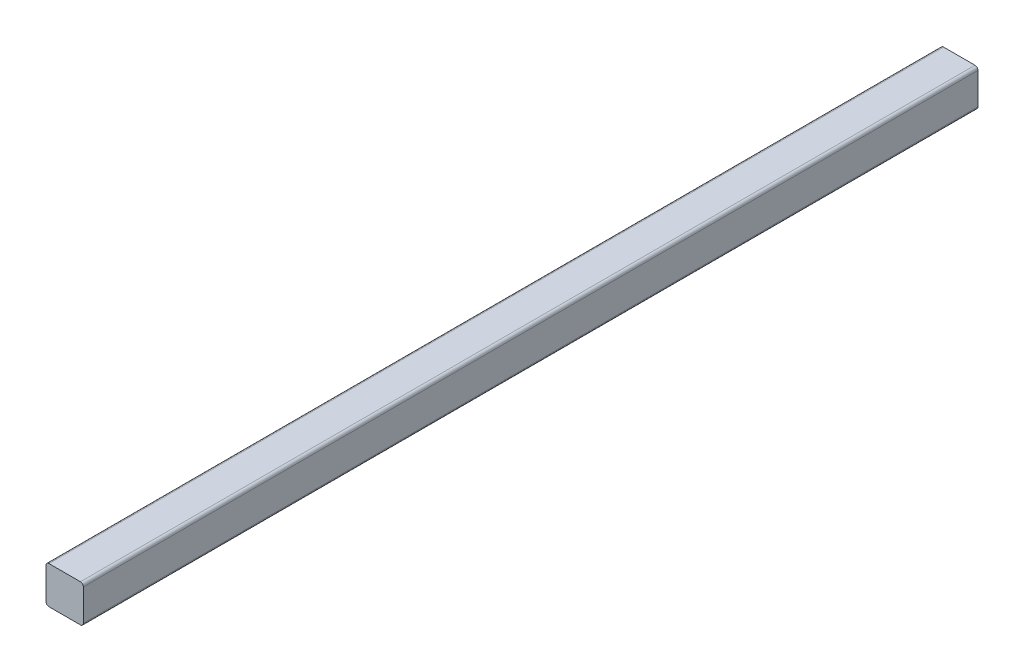
ISO-10303-21;
HEADER;
FILE_DESCRIPTION(('STEP AP214'),'2;1');
FILE_NAME('part.step','',(''),(''),'','','');
FILE_SCHEMA(('AUTOMOTIVE_DESIGN { 1 0 10303 214 1 1 1 1 }'));
ENDSEC;
DATA;
#1=APPLICATION_CONTEXT('core data for automotive mechanical design processes');
#2=APPLICATION_PROTOCOL_DEFINITION('international standard','automotive_design',2000,#1);
#3=PRODUCT_CONTEXT('',#1,'mechanical');
#4=PRODUCT('Part','Part','',(#3));
#5=PRODUCT_RELATED_PRODUCT_CATEGORY('part','',(#4));
#6=PRODUCT_DEFINITION_FORMATION('','',#4);
#7=PRODUCT_DEFINITION_CONTEXT('part definition',#1,'design');
#8=PRODUCT_DEFINITION('design','',#6,#7);
#9=PRODUCT_DEFINITION_SHAPE('','',#8);
#10=(LENGTH_UNIT() NAMED_UNIT(*) SI_UNIT(.MILLI.,.METRE.));
#11=(NAMED_UNIT(*) PLANE_ANGLE_UNIT() SI_UNIT($,.RADIAN.));
#12=(NAMED_UNIT(*) SI_UNIT($,.STERADIAN.) SOLID_ANGLE_UNIT());
#13=UNCERTAINTY_MEASURE_WITH_UNIT(LENGTH_MEASURE(1.E-05),#10,'distance_accuracy_value','');
#14=(GEOMETRIC_REPRESENTATION_CONTEXT(3) GLOBAL_UNCERTAINTY_ASSIGNED_CONTEXT((#13)) GLOBAL_UNIT_ASSIGNED_CONTEXT((#10,
#11,#12)) REPRESENTATION_CONTEXT('',''));
#15=CARTESIAN_POINT('',(0.,0.,0.));
#16=DIRECTION('',(0.,0.,1.));
#17=DIRECTION('',(1.,0.,0.));
#18=AXIS2_PLACEMENT_3D('',#15,#16,#17);
#19=CARTESIAN_POINT('',(-1.5875,1.5875,152.4));
#20=DIRECTION('',(0.,-1.,0.));
#21=DIRECTION('',(0.,0.,-1.));
#22=AXIS2_PLACEMENT_3D('',#19,#20,#21);
#23=PLANE('',#22);
#24=DIRECTION('',(0.,0.,-1.));
#25=VECTOR('',#24,1.);
#26=CARTESIAN_POINT('',(1.33350000000002,1.5875,152.4));
#27=LINE('',#26,#25);
#28=CARTESIAN_POINT('',(1.33349999999982,1.5875,-88.9));
#29=VERTEX_POINT('',#28);
#30=CARTESIAN_POINT('',(1.33349999999988,1.5875,-12.9496675796954));
#31=VERTEX_POINT('',#30);
#32=EDGE_CURVE('E126',#29,#31,#27,.F.);
#33=ORIENTED_EDGE('',*,*,#32,.F.);
#34=DIRECTION('',(-1.,0.,0.));
#35=VECTOR('',#34,1.);
#36=CARTESIAN_POINT('',(-1.5875,1.5875,-88.9));
#37=LINE('',#36,#35);
#38=CARTESIAN_POINT('',(-1.33349999999994,1.5875,-88.9));
#39=VERTEX_POINT('',#38);
#40=EDGE_CURVE('E153',#29,#39,#37,.T.);
#41=ORIENTED_EDGE('',*,*,#40,.T.);
#42=DIRECTION('',(0.,0.,-1.));
#43=VECTOR('',#42,1.);
#44=CARTESIAN_POINT('',(-1.33350000000002,1.5875,152.4));
#45=LINE('',#44,#43);
#46=CARTESIAN_POINT('',(-1.33349999999988,1.5875,-12.9496675796954));
#47=VERTEX_POINT('',#46);
#48=EDGE_CURVE('E123',#47,#39,#45,.T.);
#49=ORIENTED_EDGE('',*,*,#48,.F.);
#50=DIRECTION('',(1.,0.,0.));
#51=VECTOR('',#50,1.);
#52=CARTESIAN_POINT('',(-1.5875,1.5875,-12.9496675796954));
#53=LINE('',#52,#51);
#54=EDGE_CURVE('E133',#47,#31,#53,.T.);
#55=ORIENTED_EDGE('',*,*,#54,.T.);
#56=EDGE_LOOP('',(#33,#41,#49,#55));
#57=FACE_BOUND('',#56,.T.);
#58=ADVANCED_FACE('F33',(#57),#23,.F.);
#59=CARTESIAN_POINT('',(1.3335,1.3335,152.4));
#60=DIRECTION('',(0.,0.,-1.));
#61=DIRECTION('',(-1.,0.,0.));
#62=AXIS2_PLACEMENT_3D('',#59,#60,#61);
#63=CYLINDRICAL_SURFACE('',#62,0.254);
#64=CARTESIAN_POINT('',(1.3335,1.3335,-88.9));
#65=DIRECTION('',(0.,0.,1.));
#66=DIRECTION('',(1.,0.,0.));
#67=AXIS2_PLACEMENT_3D('',#64,#65,#66);
#68=CIRCLE('',#67,0.254);
#69=CARTESIAN_POINT('',(1.5875,1.33349999999994,-88.9));
#70=VERTEX_POINT('',#69);
#71=EDGE_CURVE('E156',#29,#70,#68,.F.);
#72=ORIENTED_EDGE('',*,*,#71,.F.);
#73=ORIENTED_EDGE('',*,*,#32,.T.);
#74=CARTESIAN_POINT('',(1.3335,1.3335,-12.9496675796954));
#75=DIRECTION('',(0.,0.,-1.));
#76=DIRECTION('',(-1.,0.,0.));
#77=AXIS2_PLACEMENT_3D('',#74,#75,#76);
#78=CIRCLE('',#77,0.254);
#79=CARTESIAN_POINT('',(1.5875,1.33349999999988,-12.9496675796954));
#80=VERTEX_POINT('',#79);
#81=EDGE_CURVE('E138',#80,#31,#78,.F.);
#82=ORIENTED_EDGE('',*,*,#81,.F.);
#83=DIRECTION('',(0.,0.,1.));
#84=VECTOR('',#83,1.);
#85=CARTESIAN_POINT('',(1.5875,1.33350000000002,152.4));
#86=LINE('',#85,#84);
#87=EDGE_CURVE('E120',#80,#70,#86,.F.);
#88=ORIENTED_EDGE('',*,*,#87,.T.);
#89=EDGE_LOOP('',(#72,#73,#82,#88));
#90=FACE_BOUND('',#89,.T.);
#91=ADVANCED_FACE('F171',(#90),#63,.T.);
#92=CARTESIAN_POINT('',(-1.3335,1.3335,152.4));
#93=DIRECTION('',(0.,0.,-1.));
#94=DIRECTION('',(-1.,0.,0.));
#95=AXIS2_PLACEMENT_3D('',#92,#93,#94);
#96=CYLINDRICAL_SURFACE('',#95,0.254);
#97=CARTESIAN_POINT('',(-1.3335,1.3335,-88.9));
#98=DIRECTION('',(0.,0.,1.));
#99=DIRECTION('',(1.,0.,0.));
#100=AXIS2_PLACEMENT_3D('',#97,#98,#99);
#101=CIRCLE('',#100,0.254);
#102=CARTESIAN_POINT('',(-1.5875,1.33349999999982,-88.9));
#103=VERTEX_POINT('',#102);
#104=EDGE_CURVE('E158',#103,#39,#101,.F.);
#105=ORIENTED_EDGE('',*,*,#104,.F.);
#106=DIRECTION('',(0.,0.,-1.));
#107=VECTOR('',#106,1.);
#108=CARTESIAN_POINT('',(-1.5875,1.33350000000002,152.4));
#109=LINE('',#108,#107);
#110=CARTESIAN_POINT('',(-1.5875,1.33349999999988,-12.9496675796954));
#111=VERTEX_POINT('',#110);
#112=EDGE_CURVE('E118',#103,#111,#109,.F.);
#113=ORIENTED_EDGE('',*,*,#112,.T.);
#114=CARTESIAN_POINT('',(-1.3335,1.3335,-12.9496675796954));
#115=DIRECTION('',(0.,0.,-1.));
#116=DIRECTION('',(-1.,0.,0.));
#117=AXIS2_PLACEMENT_3D('',#114,#115,#116);
#118=CIRCLE('',#117,0.254);
#119=EDGE_CURVE('E112',#47,#111,#118,.F.);
#120=ORIENTED_EDGE('',*,*,#119,.F.);
#121=ORIENTED_EDGE('',*,*,#48,.T.);
#122=EDGE_LOOP('',(#105,#113,#120,#121));
#123=FACE_BOUND('',#122,.T.);
#124=ADVANCED_FACE('F170',(#123),#96,.T.);
#125=CARTESIAN_POINT('',(1.5875,-1.5875,152.4));
#126=DIRECTION('',(-1.,0.,0.));
#127=DIRECTION('',(0.,0.,1.));
#128=AXIS2_PLACEMENT_3D('',#125,#126,#127);
#129=PLANE('',#128);
#130=DIRECTION('',(0.,0.,-1.));
#131=VECTOR('',#130,1.);
#132=CARTESIAN_POINT('',(1.5875,-1.33350000000002,152.4));
#133=LINE('',#132,#131);
#134=CARTESIAN_POINT('',(1.5875,-1.3335,-88.9));
#135=VERTEX_POINT('',#134);
#136=CARTESIAN_POINT('',(1.5875,-1.33349999999988,-12.9496675796954));
#137=VERTEX_POINT('',#136);
#138=EDGE_CURVE('E116',#135,#137,#133,.F.);
#139=ORIENTED_EDGE('',*,*,#138,.F.);
#140=DIRECTION('',(0.,1.,0.));
#141=VECTOR('',#140,1.);
#142=CARTESIAN_POINT('',(1.5875,-1.5875,-88.9));
#143=LINE('',#142,#141);
#144=EDGE_CURVE('E160',#135,#70,#143,.T.);
#145=ORIENTED_EDGE('',*,*,#144,.T.);
#146=ORIENTED_EDGE('',*,*,#87,.F.);
#147=DIRECTION('',(0.,-1.,0.));
#148=VECTOR('',#147,1.);
#149=CARTESIAN_POINT('',(1.5875,-1.5875,-12.9496675796954));
#150=LINE('',#149,#148);
#151=EDGE_CURVE('E141',#80,#137,#150,.T.);
#152=ORIENTED_EDGE('',*,*,#151,.T.);
#153=EDGE_LOOP('',(#139,#145,#146,#152));
#154=FACE_BOUND('',#153,.T.);
#155=ADVANCED_FACE('F175',(#154),#129,.F.);
#156=CARTESIAN_POINT('',(-1.5875,-1.5875,152.4));
#157=DIRECTION('',(1.,0.,0.));
#158=DIRECTION('',(0.,0.,-1.));
#159=AXIS2_PLACEMENT_3D('',#156,#157,#158);
#160=PLANE('',#159);
#161=ORIENTED_EDGE('',*,*,#112,.F.);
#162=DIRECTION('',(0.,-1.,0.));
#163=VECTOR('',#162,1.);
#164=CARTESIAN_POINT('',(-1.5875,-1.5875,-88.9));
#165=LINE('',#164,#163);
#166=CARTESIAN_POINT('',(-1.5875,-1.3335,-88.9));
#167=VERTEX_POINT('',#166);
#168=EDGE_CURVE('E163',#103,#167,#165,.T.);
#169=ORIENTED_EDGE('',*,*,#168,.T.);
#170=DIRECTION('',(0.,0.,-1.));
#171=VECTOR('',#170,1.);
#172=CARTESIAN_POINT('',(-1.5875,-1.3335,152.4));
#173=LINE('',#172,#171);
#174=CARTESIAN_POINT('',(-1.5875,-1.3335,-12.9496675796954));
#175=VERTEX_POINT('',#174);
#176=EDGE_CURVE('E104',#175,#167,#173,.T.);
#177=ORIENTED_EDGE('',*,*,#176,.F.);
#178=DIRECTION('',(0.,-1.,0.));
#179=VECTOR('',#178,1.);
#180=CARTESIAN_POINT('',(-1.5875,13.7833198887165,-12.9496675796954));
#181=LINE('',#180,#179);
#182=EDGE_CURVE('E151',#111,#175,#181,.T.);
#183=ORIENTED_EDGE('',*,*,#182,.F.);
#184=EDGE_LOOP('',(#161,#169,#177,#183));
#185=FACE_BOUND('',#184,.T.);
#186=ADVANCED_FACE('F167',(#185),#160,.F.);
#187=CARTESIAN_POINT('',(1.3335,-1.3335,152.4));
#188=DIRECTION('',(0.,0.,-1.));
#189=DIRECTION('',(-1.,0.,0.));
#190=AXIS2_PLACEMENT_3D('',#187,#188,#189);
#191=CYLINDRICAL_SURFACE('',#190,0.254);
#192=CARTESIAN_POINT('',(1.3335,-1.3335,-88.9));
#193=DIRECTION('',(0.,0.,1.));
#194=DIRECTION('',(1.,0.,0.));
#195=AXIS2_PLACEMENT_3D('',#192,#193,#194);
#196=CIRCLE('',#195,0.254);
#197=CARTESIAN_POINT('',(1.33350000000002,-1.5875,-88.9));
#198=VERTEX_POINT('',#197);
#199=EDGE_CURVE('E47',#135,#198,#196,.F.);
#200=ORIENTED_EDGE('',*,*,#199,.F.);
#201=ORIENTED_EDGE('',*,*,#138,.T.);
#202=CARTESIAN_POINT('',(1.3335,-1.3335,-12.9496675796954));
#203=DIRECTION('',(0.,0.,-1.));
#204=DIRECTION('',(-1.,0.,0.));
#205=AXIS2_PLACEMENT_3D('',#202,#203,#204);
#206=CIRCLE('',#205,0.254);
#207=CARTESIAN_POINT('',(1.33349999999988,-1.5875,-12.9496675796954));
#208=VERTEX_POINT('',#207);
#209=EDGE_CURVE('E146',#208,#137,#206,.F.);
#210=ORIENTED_EDGE('',*,*,#209,.F.);
#211=DIRECTION('',(0.,0.,1.));
#212=VECTOR('',#211,1.);
#213=CARTESIAN_POINT('',(1.33350000000002,-1.5875,152.4));
#214=LINE('',#213,#212);
#215=EDGE_CURVE('E108',#208,#198,#214,.F.);
#216=ORIENTED_EDGE('',*,*,#215,.T.);
#217=EDGE_LOOP('',(#200,#201,#210,#216));
#218=FACE_BOUND('',#217,.T.);
#219=ADVANCED_FACE('F177',(#218),#191,.T.);
#220=CARTESIAN_POINT('',(-1.3335,-1.3335,152.4));
#221=DIRECTION('',(0.,0.,-1.));
#222=DIRECTION('',(-1.,0.,0.));
#223=AXIS2_PLACEMENT_3D('',#220,#221,#222);
#224=CYLINDRICAL_SURFACE('',#223,0.254);
#225=CARTESIAN_POINT('',(-1.3335,-1.3335,-88.9));
#226=DIRECTION('',(0.,0.,1.));
#227=DIRECTION('',(1.,0.,0.));
#228=AXIS2_PLACEMENT_3D('',#225,#226,#227);
#229=CIRCLE('',#228,0.254);
#230=CARTESIAN_POINT('',(-1.33349999999989,-1.5875,-88.9));
#231=VERTEX_POINT('',#230);
#232=EDGE_CURVE('E96',#231,#167,#229,.F.);
#233=ORIENTED_EDGE('',*,*,#232,.F.);
#234=DIRECTION('',(0.,0.,1.));
#235=VECTOR('',#234,1.);
#236=CARTESIAN_POINT('',(-1.33350000000002,-1.5875,152.4));
#237=LINE('',#236,#235);
#238=CARTESIAN_POINT('',(-1.33350000000002,-1.5875,-12.9496675796954));
#239=VERTEX_POINT('',#238);
#240=EDGE_CURVE('E54',#231,#239,#237,.T.);
#241=ORIENTED_EDGE('',*,*,#240,.T.);
#242=CARTESIAN_POINT('',(-1.3335,-1.3335,-12.9496675796954));
#243=DIRECTION('',(0.,0.,-1.));
#244=DIRECTION('',(-1.,0.,0.));
#245=AXIS2_PLACEMENT_3D('',#242,#243,#244);
#246=CIRCLE('',#245,0.254);
#247=EDGE_CURVE('E149',#175,#239,#246,.F.);
#248=ORIENTED_EDGE('',*,*,#247,.F.);
#249=ORIENTED_EDGE('',*,*,#176,.T.);
#250=EDGE_LOOP('',(#233,#241,#248,#249));
#251=FACE_BOUND('',#250,.T.);
#252=ADVANCED_FACE('F102',(#251),#224,.T.);
#253=CARTESIAN_POINT('',(-1.5875,-1.5875,152.4));
#254=DIRECTION('',(0.,1.,0.));
#255=DIRECTION('',(0.,0.,1.));
#256=AXIS2_PLACEMENT_3D('',#253,#254,#255);
#257=PLANE('',#256);
#258=ORIENTED_EDGE('',*,*,#240,.F.);
#259=DIRECTION('',(1.,0.,0.));
#260=VECTOR('',#259,1.);
#261=CARTESIAN_POINT('',(-1.5875,-1.5875,-88.9));
#262=LINE('',#261,#260);
#263=EDGE_CURVE('E11',#231,#198,#262,.T.);
#264=ORIENTED_EDGE('',*,*,#263,.T.);
#265=ORIENTED_EDGE('',*,*,#215,.F.);
#266=DIRECTION('',(-1.,0.,0.));
#267=VECTOR('',#266,1.);
#268=CARTESIAN_POINT('',(-1.5875,-1.5875,-12.9496675796954));
#269=LINE('',#268,#267);
#270=EDGE_CURVE('E40',#208,#239,#269,.T.);
#271=ORIENTED_EDGE('',*,*,#270,.T.);
#272=EDGE_LOOP('',(#258,#264,#265,#271));
#273=FACE_BOUND('',#272,.T.);
#274=ADVANCED_FACE('F107',(#273),#257,.F.);
#275=CARTESIAN_POINT('',(2.08789099172827,13.7833198887165,-12.9496675796954));
#276=DIRECTION('',(0.,0.,-1.));
#277=DIRECTION('',(-1.,0.,0.));
#278=AXIS2_PLACEMENT_3D('',#275,#276,#277);
#279=PLANE('',#278);
#280=ORIENTED_EDGE('',*,*,#119,.T.);
#281=ORIENTED_EDGE('',*,*,#182,.T.);
#282=ORIENTED_EDGE('',*,*,#247,.T.);
#283=ORIENTED_EDGE('',*,*,#270,.F.);
#284=ORIENTED_EDGE('',*,*,#209,.T.);
#285=ORIENTED_EDGE('',*,*,#151,.F.);
#286=ORIENTED_EDGE('',*,*,#81,.T.);
#287=ORIENTED_EDGE('',*,*,#54,.F.);
#288=EDGE_LOOP('',(#280,#281,#282,#283,#284,#285,#286,#287));
#289=FACE_BOUND('',#288,.T.);
#290=ADVANCED_FACE('F179',(#289),#279,.F.);
#291=CARTESIAN_POINT('',(0.,0.,-88.9));
#292=DIRECTION('',(0.,0.,1.));
#293=DIRECTION('',(1.,0.,0.));
#294=AXIS2_PLACEMENT_3D('',#291,#292,#293);
#295=PLANE('',#294);
#296=ORIENTED_EDGE('',*,*,#71,.T.);
#297=ORIENTED_EDGE('',*,*,#144,.F.);
#298=ORIENTED_EDGE('',*,*,#199,.T.);
#299=ORIENTED_EDGE('',*,*,#263,.F.);
#300=ORIENTED_EDGE('',*,*,#232,.T.);
#301=ORIENTED_EDGE('',*,*,#168,.F.);
#302=ORIENTED_EDGE('',*,*,#104,.T.);
#303=ORIENTED_EDGE('',*,*,#40,.F.);
#304=EDGE_LOOP('',(#296,#297,#298,#299,#300,#301,#302,#303));
#305=FACE_BOUND('',#304,.T.);
#306=ADVANCED_FACE('F95',(#305),#295,.F.);
#307=CLOSED_SHELL('',(#58,#91,#124,#155,#186,#219,#252,#274,#290,#306));
#308=MANIFOLD_SOLID_BREP('B2',#307);
#309=ADVANCED_BREP_SHAPE_REPRESENTATION('',(#18,#308),#14);
#310=SHAPE_DEFINITION_REPRESENTATION(#9,#309);
ENDSEC;
END-ISO-10303-21;
